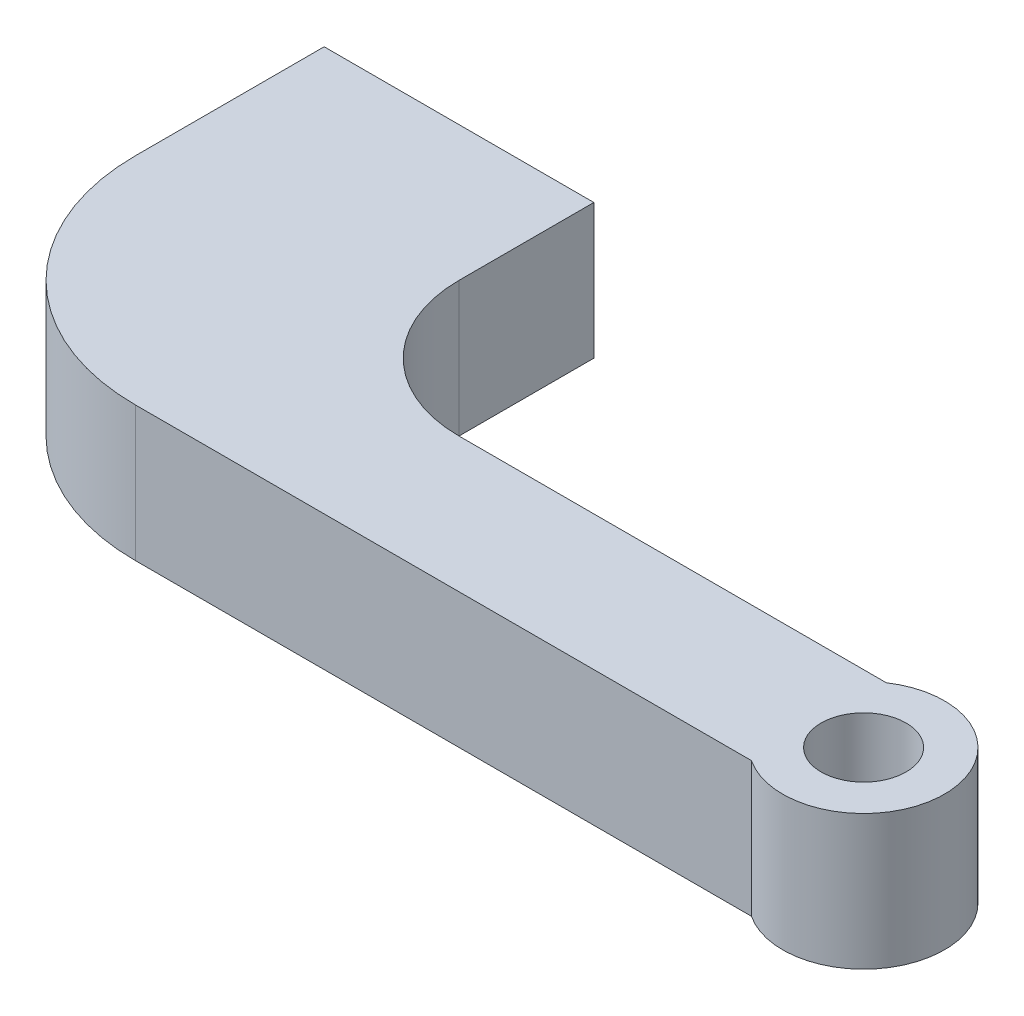
ISO-10303-21;
HEADER;
FILE_DESCRIPTION(('STEP AP214'),'2;1');
FILE_NAME('part.step','',(''),(''),'','','');
FILE_SCHEMA(('AUTOMOTIVE_DESIGN { 1 0 10303 214 1 1 1 1 }'));
ENDSEC;
DATA;
#1=APPLICATION_CONTEXT('core data for automotive mechanical design processes');
#2=APPLICATION_PROTOCOL_DEFINITION('international standard','automotive_design',2000,#1);
#3=PRODUCT_CONTEXT('',#1,'mechanical');
#4=PRODUCT('Part','Part','',(#3));
#5=PRODUCT_RELATED_PRODUCT_CATEGORY('part','',(#4));
#6=PRODUCT_DEFINITION_FORMATION('','',#4);
#7=PRODUCT_DEFINITION_CONTEXT('part definition',#1,'design');
#8=PRODUCT_DEFINITION('design','',#6,#7);
#9=PRODUCT_DEFINITION_SHAPE('','',#8);
#10=(LENGTH_UNIT() NAMED_UNIT(*) SI_UNIT(.MILLI.,.METRE.));
#11=(NAMED_UNIT(*) PLANE_ANGLE_UNIT() SI_UNIT($,.RADIAN.));
#12=(NAMED_UNIT(*) SI_UNIT($,.STERADIAN.) SOLID_ANGLE_UNIT());
#13=UNCERTAINTY_MEASURE_WITH_UNIT(LENGTH_MEASURE(1.E-05),#10,'distance_accuracy_value','');
#14=(GEOMETRIC_REPRESENTATION_CONTEXT(3) GLOBAL_UNCERTAINTY_ASSIGNED_CONTEXT((#13)) GLOBAL_UNIT_ASSIGNED_CONTEXT((#10,
#11,#12)) REPRESENTATION_CONTEXT('',''));
#15=CARTESIAN_POINT('',(0.,0.,0.));
#16=DIRECTION('',(0.,0.,1.));
#17=DIRECTION('',(1.,0.,0.));
#18=AXIS2_PLACEMENT_3D('',#15,#16,#17);
#19=CARTESIAN_POINT('',(10.16,6.35,8.89));
#20=DIRECTION('',(0.,-1.,0.));
#21=DIRECTION('',(0.,0.,1.));
#22=AXIS2_PLACEMENT_3D('',#19,#20,#21);
#23=PLANE('',#22);
#24=DIRECTION('',(0.,0.,-1.));
#25=VECTOR('',#24,1.);
#26=CARTESIAN_POINT('',(0.,6.35,0.));
#27=LINE('',#26,#25);
#28=CARTESIAN_POINT('',(0.,6.35,8.88999999999993));
#29=VERTEX_POINT('',#28);
#30=CARTESIAN_POINT('',(0.,6.35,0.));
#31=VERTEX_POINT('',#30);
#32=EDGE_CURVE('E153',#29,#31,#27,.T.);
#33=ORIENTED_EDGE('',*,*,#32,.F.);
#34=CARTESIAN_POINT('',(10.16,6.35,8.89));
#35=DIRECTION('',(0.,-1.,0.));
#36=DIRECTION('',(0.,0.,1.));
#37=AXIS2_PLACEMENT_3D('',#34,#35,#36);
#38=CIRCLE('',#37,10.16);
#39=CARTESIAN_POINT('',(10.1600000000001,6.35,19.05));
#40=VERTEX_POINT('',#39);
#41=EDGE_CURVE('E127',#40,#29,#38,.T.);
#42=ORIENTED_EDGE('',*,*,#41,.F.);
#43=DIRECTION('',(-1.,0.,0.));
#44=VECTOR('',#43,1.);
#45=CARTESIAN_POINT('',(12.7,6.35,19.05));
#46=LINE('',#45,#44);
#47=CARTESIAN_POINT('',(39.1690715235572,6.35,19.05));
#48=VERTEX_POINT('',#47);
#49=EDGE_CURVE('E108',#48,#40,#46,.T.);
#50=ORIENTED_EDGE('',*,*,#49,.F.);
#51=CARTESIAN_POINT('',(41.275,6.35,15.8749149220678));
#52=DIRECTION('',(0.,-1.,0.));
#53=DIRECTION('',(0.,0.,-1.));
#54=AXIS2_PLACEMENT_3D('',#51,#52,#53);
#55=CIRCLE('',#54,3.81);
#56=CARTESIAN_POINT('',(39.1688150039394,6.35,12.7));
#57=VERTEX_POINT('',#56);
#58=EDGE_CURVE('E118',#57,#48,#55,.T.);
#59=ORIENTED_EDGE('',*,*,#58,.F.);
#60=DIRECTION('',(1.,0.,0.));
#61=VECTOR('',#60,1.);
#62=CARTESIAN_POINT('',(19.05,6.35,12.7));
#63=LINE('',#62,#61);
#64=CARTESIAN_POINT('',(19.05,6.35,12.7));
#65=VERTEX_POINT('',#64);
#66=EDGE_CURVE('E123',#65,#57,#63,.T.);
#67=ORIENTED_EDGE('',*,*,#66,.F.);
#68=CARTESIAN_POINT('',(19.05,6.35,6.35));
#69=DIRECTION('',(0.,1.,0.));
#70=DIRECTION('',(0.,0.,-1.));
#71=AXIS2_PLACEMENT_3D('',#68,#69,#70);
#72=CIRCLE('',#71,6.35);
#73=CARTESIAN_POINT('',(12.7,6.35,6.34999999999995));
#74=VERTEX_POINT('',#73);
#75=EDGE_CURVE('E179',#74,#65,#72,.T.);
#76=ORIENTED_EDGE('',*,*,#75,.F.);
#77=DIRECTION('',(0.,0.,1.));
#78=VECTOR('',#77,1.);
#79=CARTESIAN_POINT('',(12.7,6.35,0.));
#80=LINE('',#79,#78);
#81=CARTESIAN_POINT('',(12.7,6.35,0.));
#82=VERTEX_POINT('',#81);
#83=EDGE_CURVE('E172',#82,#74,#80,.T.);
#84=ORIENTED_EDGE('',*,*,#83,.F.);
#85=DIRECTION('',(1.,0.,0.));
#86=VECTOR('',#85,1.);
#87=CARTESIAN_POINT('',(0.,6.35,0.));
#88=LINE('',#87,#86);
#89=EDGE_CURVE('E162',#31,#82,#88,.T.);
#90=ORIENTED_EDGE('',*,*,#89,.F.);
#91=EDGE_LOOP('',(#33,#42,#50,#59,#67,#76,#84,#90));
#92=FACE_BOUND('',#91,.T.);
#93=CARTESIAN_POINT('',(41.275,6.35,15.8749149220678));
#94=DIRECTION('',(0.,-1.,0.));
#95=DIRECTION('',(0.,0.,-1.));
#96=AXIS2_PLACEMENT_3D('',#93,#94,#95);
#97=CIRCLE('',#96,2.);
#98=CARTESIAN_POINT('',(41.275,6.35,13.8749149220678));
#99=VERTEX_POINT('',#98);
#100=EDGE_CURVE('E136',#99,#99,#97,.T.);
#101=ORIENTED_EDGE('',*,*,#100,.T.);
#102=EDGE_LOOP('',(#101));
#103=FACE_BOUND('',#102,.T.);
#104=ADVANCED_FACE('F35',(#92,#103),#23,.F.);
#105=CARTESIAN_POINT('',(10.16,0.,8.89));
#106=DIRECTION('',(0.,-1.,0.));
#107=DIRECTION('',(0.,0.,1.));
#108=AXIS2_PLACEMENT_3D('',#105,#106,#107);
#109=PLANE('',#108);
#110=DIRECTION('',(0.,0.,-1.));
#111=VECTOR('',#110,1.);
#112=CARTESIAN_POINT('',(0.,0.,0.));
#113=LINE('',#112,#111);
#114=CARTESIAN_POINT('',(0.,0.,8.88999999999993));
#115=VERTEX_POINT('',#114);
#116=CARTESIAN_POINT('',(0.,0.,0.));
#117=VERTEX_POINT('',#116);
#118=EDGE_CURVE('E132',#115,#117,#113,.T.);
#119=ORIENTED_EDGE('',*,*,#118,.T.);
#120=DIRECTION('',(1.,0.,0.));
#121=VECTOR('',#120,1.);
#122=CARTESIAN_POINT('',(0.,0.,0.));
#123=LINE('',#122,#121);
#124=CARTESIAN_POINT('',(12.7,0.,0.));
#125=VERTEX_POINT('',#124);
#126=EDGE_CURVE('E135',#117,#125,#123,.T.);
#127=ORIENTED_EDGE('',*,*,#126,.T.);
#128=DIRECTION('',(0.,0.,1.));
#129=VECTOR('',#128,1.);
#130=CARTESIAN_POINT('',(12.7,0.,0.));
#131=LINE('',#130,#129);
#132=CARTESIAN_POINT('',(12.7,0.,6.34999999999995));
#133=VERTEX_POINT('',#132);
#134=EDGE_CURVE('E139',#125,#133,#131,.T.);
#135=ORIENTED_EDGE('',*,*,#134,.T.);
#136=CARTESIAN_POINT('',(19.05,0.,6.35));
#137=DIRECTION('',(0.,1.,0.));
#138=DIRECTION('',(0.,0.,-1.));
#139=AXIS2_PLACEMENT_3D('',#136,#137,#138);
#140=CIRCLE('',#139,6.35);
#141=CARTESIAN_POINT('',(19.05,0.,12.7));
#142=VERTEX_POINT('',#141);
#143=EDGE_CURVE('E142',#133,#142,#140,.T.);
#144=ORIENTED_EDGE('',*,*,#143,.T.);
#145=DIRECTION('',(1.,0.,0.));
#146=VECTOR('',#145,1.);
#147=CARTESIAN_POINT('',(19.05,0.,12.7));
#148=LINE('',#147,#146);
#149=CARTESIAN_POINT('',(39.1688150039394,0.,12.7));
#150=VERTEX_POINT('',#149);
#151=EDGE_CURVE('E145',#142,#150,#148,.T.);
#152=ORIENTED_EDGE('',*,*,#151,.T.);
#153=CARTESIAN_POINT('',(41.275,0.,15.8749149220678));
#154=DIRECTION('',(0.,-1.,0.));
#155=DIRECTION('',(0.,0.,-1.));
#156=AXIS2_PLACEMENT_3D('',#153,#154,#155);
#157=CIRCLE('',#156,3.81);
#158=CARTESIAN_POINT('',(39.1690715235572,0.,19.05));
#159=VERTEX_POINT('',#158);
#160=EDGE_CURVE('E148',#150,#159,#157,.T.);
#161=ORIENTED_EDGE('',*,*,#160,.T.);
#162=DIRECTION('',(-1.,0.,0.));
#163=VECTOR('',#162,1.);
#164=CARTESIAN_POINT('',(10.1600000000001,0.,19.05));
#165=LINE('',#164,#163);
#166=CARTESIAN_POINT('',(10.1600000000001,0.,19.05));
#167=VERTEX_POINT('',#166);
#168=EDGE_CURVE('E111',#159,#167,#165,.T.);
#169=ORIENTED_EDGE('',*,*,#168,.T.);
#170=CARTESIAN_POINT('',(10.16,0.,8.89));
#171=DIRECTION('',(0.,-1.,0.));
#172=DIRECTION('',(0.,0.,1.));
#173=AXIS2_PLACEMENT_3D('',#170,#171,#172);
#174=CIRCLE('',#173,10.16);
#175=EDGE_CURVE('E151',#167,#115,#174,.T.);
#176=ORIENTED_EDGE('',*,*,#175,.T.);
#177=EDGE_LOOP('',(#119,#127,#135,#144,#152,#161,#169,#176));
#178=FACE_BOUND('',#177,.T.);
#179=CARTESIAN_POINT('',(41.275,0.,15.8749149220678));
#180=DIRECTION('',(0.,-1.,0.));
#181=DIRECTION('',(0.,0.,-1.));
#182=AXIS2_PLACEMENT_3D('',#179,#180,#181);
#183=CIRCLE('',#182,2.);
#184=CARTESIAN_POINT('',(41.275,0.,13.8749149220678));
#185=VERTEX_POINT('',#184);
#186=EDGE_CURVE('E175',#185,#185,#183,.T.);
#187=ORIENTED_EDGE('',*,*,#186,.F.);
#188=EDGE_LOOP('',(#187));
#189=FACE_BOUND('',#188,.T.);
#190=ADVANCED_FACE('F169',(#178,#189),#109,.T.);
#191=CARTESIAN_POINT('',(0.,6.35,0.));
#192=DIRECTION('',(1.,0.,0.));
#193=DIRECTION('',(0.,0.,1.));
#194=AXIS2_PLACEMENT_3D('',#191,#192,#193);
#195=PLANE('',#194);
#196=ORIENTED_EDGE('',*,*,#118,.F.);
#197=DIRECTION('',(0.,-1.,0.));
#198=VECTOR('',#197,1.);
#199=CARTESIAN_POINT('',(0.,6.35,8.88999999999993));
#200=LINE('',#199,#198);
#201=EDGE_CURVE('E52',#29,#115,#200,.T.);
#202=ORIENTED_EDGE('',*,*,#201,.F.);
#203=ORIENTED_EDGE('',*,*,#32,.T.);
#204=DIRECTION('',(0.,-1.,0.));
#205=VECTOR('',#204,1.);
#206=CARTESIAN_POINT('',(0.,6.35,0.));
#207=LINE('',#206,#205);
#208=EDGE_CURVE('E11',#31,#117,#207,.T.);
#209=ORIENTED_EDGE('',*,*,#208,.T.);
#210=EDGE_LOOP('',(#196,#202,#203,#209));
#211=FACE_BOUND('',#210,.T.);
#212=ADVANCED_FACE('F37',(#211),#195,.F.);
#213=CARTESIAN_POINT('',(0.,6.35,0.));
#214=DIRECTION('',(0.,0.,1.));
#215=DIRECTION('',(-1.,0.,0.));
#216=AXIS2_PLACEMENT_3D('',#213,#214,#215);
#217=PLANE('',#216);
#218=ORIENTED_EDGE('',*,*,#126,.F.);
#219=ORIENTED_EDGE('',*,*,#208,.F.);
#220=ORIENTED_EDGE('',*,*,#89,.T.);
#221=DIRECTION('',(0.,-1.,0.));
#222=VECTOR('',#221,1.);
#223=CARTESIAN_POINT('',(12.7,6.35,0.));
#224=LINE('',#223,#222);
#225=EDGE_CURVE('E44',#82,#125,#224,.T.);
#226=ORIENTED_EDGE('',*,*,#225,.T.);
#227=EDGE_LOOP('',(#218,#219,#220,#226));
#228=FACE_BOUND('',#227,.T.);
#229=ADVANCED_FACE('F161',(#228),#217,.F.);
#230=CARTESIAN_POINT('',(12.7,6.35,0.));
#231=DIRECTION('',(-1.,0.,0.));
#232=DIRECTION('',(0.,0.,-1.));
#233=AXIS2_PLACEMENT_3D('',#230,#231,#232);
#234=PLANE('',#233);
#235=ORIENTED_EDGE('',*,*,#134,.F.);
#236=ORIENTED_EDGE('',*,*,#225,.F.);
#237=ORIENTED_EDGE('',*,*,#83,.T.);
#238=DIRECTION('',(0.,-1.,0.));
#239=VECTOR('',#238,1.);
#240=CARTESIAN_POINT('',(12.7,6.35,6.34999999999995));
#241=LINE('',#240,#239);
#242=EDGE_CURVE('E159',#74,#133,#241,.T.);
#243=ORIENTED_EDGE('',*,*,#242,.T.);
#244=EDGE_LOOP('',(#235,#236,#237,#243));
#245=FACE_BOUND('',#244,.T.);
#246=ADVANCED_FACE('F166',(#245),#234,.F.);
#247=CARTESIAN_POINT('',(19.05,6.35,6.35));
#248=DIRECTION('',(0.,-1.,0.));
#249=DIRECTION('',(0.,0.,1.));
#250=AXIS2_PLACEMENT_3D('',#247,#248,#249);
#251=CYLINDRICAL_SURFACE('',#250,6.35);
#252=ORIENTED_EDGE('',*,*,#143,.F.);
#253=ORIENTED_EDGE('',*,*,#242,.F.);
#254=ORIENTED_EDGE('',*,*,#75,.T.);
#255=DIRECTION('',(0.,-1.,0.));
#256=VECTOR('',#255,1.);
#257=CARTESIAN_POINT('',(19.05,6.35,12.7));
#258=LINE('',#257,#256);
#259=EDGE_CURVE('E157',#65,#142,#258,.T.);
#260=ORIENTED_EDGE('',*,*,#259,.T.);
#261=EDGE_LOOP('',(#252,#253,#254,#260));
#262=FACE_BOUND('',#261,.T.);
#263=ADVANCED_FACE('F186',(#262),#251,.F.);
#264=CARTESIAN_POINT('',(19.05,6.35,12.7));
#265=DIRECTION('',(0.,0.,1.));
#266=DIRECTION('',(-1.,0.,0.));
#267=AXIS2_PLACEMENT_3D('',#264,#265,#266);
#268=PLANE('',#267);
#269=ORIENTED_EDGE('',*,*,#151,.F.);
#270=ORIENTED_EDGE('',*,*,#259,.F.);
#271=ORIENTED_EDGE('',*,*,#66,.T.);
#272=DIRECTION('',(0.,-1.,0.));
#273=VECTOR('',#272,1.);
#274=CARTESIAN_POINT('',(39.1688150039394,6.35,12.7));
#275=LINE('',#274,#273);
#276=EDGE_CURVE('E115',#57,#150,#275,.T.);
#277=ORIENTED_EDGE('',*,*,#276,.T.);
#278=EDGE_LOOP('',(#269,#270,#271,#277));
#279=FACE_BOUND('',#278,.T.);
#280=ADVANCED_FACE('F183',(#279),#268,.F.);
#281=CARTESIAN_POINT('',(41.275,6.35,15.8749149220678));
#282=DIRECTION('',(0.,-1.,0.));
#283=DIRECTION('',(0.,0.,1.));
#284=AXIS2_PLACEMENT_3D('',#281,#282,#283);
#285=CYLINDRICAL_SURFACE('',#284,3.81);
#286=ORIENTED_EDGE('',*,*,#160,.F.);
#287=ORIENTED_EDGE('',*,*,#276,.F.);
#288=ORIENTED_EDGE('',*,*,#58,.T.);
#289=DIRECTION('',(0.,-1.,0.));
#290=VECTOR('',#289,1.);
#291=CARTESIAN_POINT('',(39.1690715235572,6.35,19.05));
#292=LINE('',#291,#290);
#293=EDGE_CURVE('E104',#48,#159,#292,.T.);
#294=ORIENTED_EDGE('',*,*,#293,.T.);
#295=EDGE_LOOP('',(#286,#287,#288,#294));
#296=FACE_BOUND('',#295,.T.);
#297=ADVANCED_FACE('F119',(#296),#285,.T.);
#298=CARTESIAN_POINT('',(10.1600000000001,6.35,19.05));
#299=DIRECTION('',(0.,0.,-1.));
#300=DIRECTION('',(1.,0.,0.));
#301=AXIS2_PLACEMENT_3D('',#298,#299,#300);
#302=PLANE('',#301);
#303=ORIENTED_EDGE('',*,*,#168,.F.);
#304=ORIENTED_EDGE('',*,*,#293,.F.);
#305=ORIENTED_EDGE('',*,*,#49,.T.);
#306=DIRECTION('',(0.,-1.,0.));
#307=VECTOR('',#306,1.);
#308=CARTESIAN_POINT('',(10.1600000000001,6.35,19.05));
#309=LINE('',#308,#307);
#310=EDGE_CURVE('E80',#40,#167,#309,.T.);
#311=ORIENTED_EDGE('',*,*,#310,.T.);
#312=EDGE_LOOP('',(#303,#304,#305,#311));
#313=FACE_BOUND('',#312,.T.);
#314=ADVANCED_FACE('F106',(#313),#302,.F.);
#315=CARTESIAN_POINT('',(10.16,6.35,8.89));
#316=DIRECTION('',(0.,-1.,0.));
#317=DIRECTION('',(0.,0.,1.));
#318=AXIS2_PLACEMENT_3D('',#315,#316,#317);
#319=CYLINDRICAL_SURFACE('',#318,10.16);
#320=ORIENTED_EDGE('',*,*,#175,.F.);
#321=ORIENTED_EDGE('',*,*,#310,.F.);
#322=ORIENTED_EDGE('',*,*,#41,.T.);
#323=ORIENTED_EDGE('',*,*,#201,.T.);
#324=EDGE_LOOP('',(#320,#321,#322,#323));
#325=FACE_BOUND('',#324,.T.);
#326=ADVANCED_FACE('F204',(#325),#319,.T.);
#327=CARTESIAN_POINT('',(41.275,6.35,15.8749149220678));
#328=DIRECTION('',(0.,-1.,0.));
#329=DIRECTION('',(0.,0.,1.));
#330=AXIS2_PLACEMENT_3D('',#327,#328,#329);
#331=CYLINDRICAL_SURFACE('',#330,2.);
#332=ORIENTED_EDGE('',*,*,#100,.F.);
#333=EDGE_LOOP('',(#332));
#334=FACE_BOUND('',#333,.T.);
#335=ORIENTED_EDGE('',*,*,#186,.T.);
#336=EDGE_LOOP('',(#335));
#337=FACE_BOUND('',#336,.T.);
#338=ADVANCED_FACE('F202',(#334,#337),#331,.F.);
#339=CLOSED_SHELL('',(#104,#190,#212,#229,#246,#263,#280,#297,#314,#326,#338));
#340=MANIFOLD_SOLID_BREP('B2',#339);
#341=ADVANCED_BREP_SHAPE_REPRESENTATION('',(#18,#340),#14);
#342=SHAPE_DEFINITION_REPRESENTATION(#9,#341);
ENDSEC;
END-ISO-10303-21;
